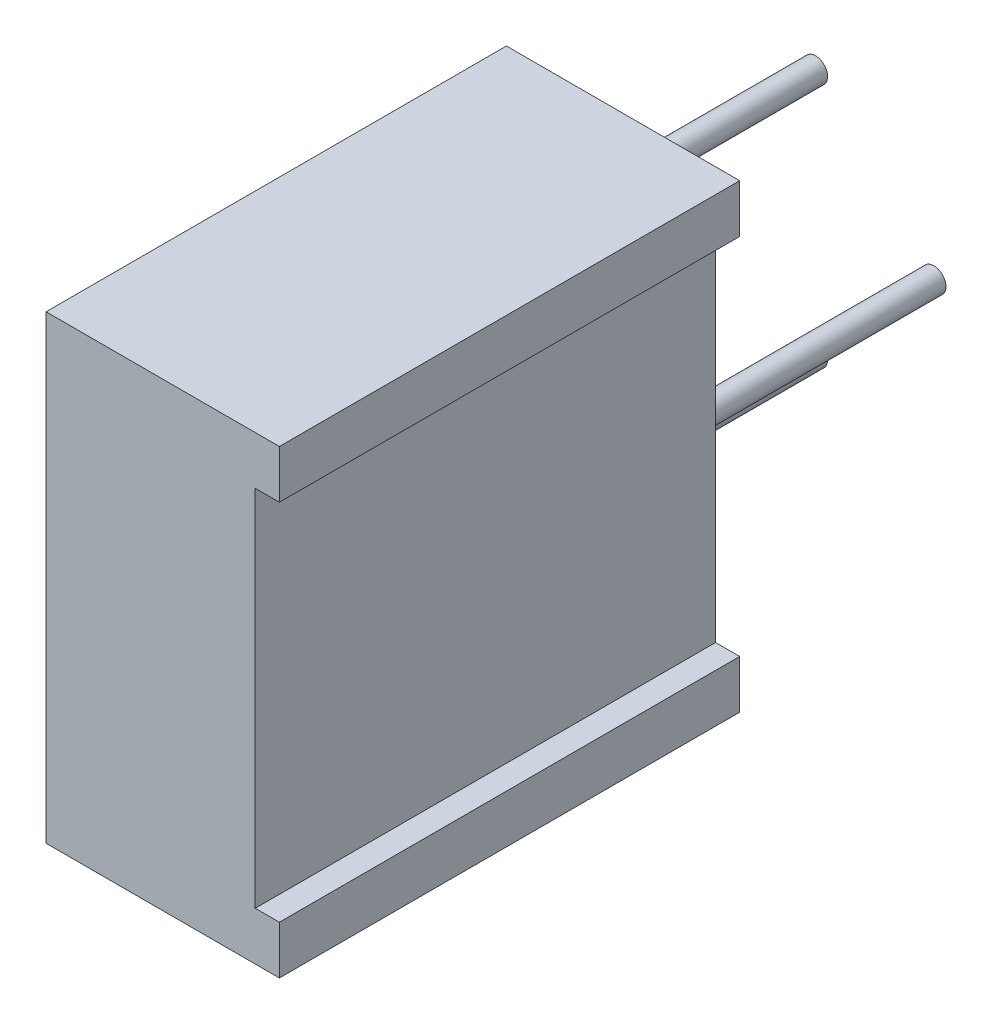
ISO-10303-21;
HEADER;
FILE_DESCRIPTION(('STEP AP214'),'2;1');
FILE_NAME('part.step','',(''),(''),'','','');
FILE_SCHEMA(('AUTOMOTIVE_DESIGN { 1 0 10303 214 1 1 1 1 }'));
ENDSEC;
DATA;
#1=APPLICATION_CONTEXT('core data for automotive mechanical design processes');
#2=APPLICATION_PROTOCOL_DEFINITION('international standard','automotive_design',2000,#1);
#3=PRODUCT_CONTEXT('',#1,'mechanical');
#4=PRODUCT('Part','Part','',(#3));
#5=PRODUCT_RELATED_PRODUCT_CATEGORY('part','',(#4));
#6=PRODUCT_DEFINITION_FORMATION('','',#4);
#7=PRODUCT_DEFINITION_CONTEXT('part definition',#1,'design');
#8=PRODUCT_DEFINITION('design','',#6,#7);
#9=PRODUCT_DEFINITION_SHAPE('','',#8);
#10=(LENGTH_UNIT() NAMED_UNIT(*) SI_UNIT(.MILLI.,.METRE.));
#11=(NAMED_UNIT(*) PLANE_ANGLE_UNIT() SI_UNIT($,.RADIAN.));
#12=(NAMED_UNIT(*) SI_UNIT($,.STERADIAN.) SOLID_ANGLE_UNIT());
#13=UNCERTAINTY_MEASURE_WITH_UNIT(LENGTH_MEASURE(1.E-05),#10,'distance_accuracy_value','');
#14=(GEOMETRIC_REPRESENTATION_CONTEXT(3) GLOBAL_UNCERTAINTY_ASSIGNED_CONTEXT((#13)) GLOBAL_UNIT_ASSIGNED_CONTEXT((#10,
#11,#12)) REPRESENTATION_CONTEXT('',''));
#15=CARTESIAN_POINT('',(0.,0.,0.));
#16=DIRECTION('',(0.,0.,1.));
#17=DIRECTION('',(1.,0.,0.));
#18=AXIS2_PLACEMENT_3D('',#15,#16,#17);
#19=CARTESIAN_POINT('',(4.83,0.,0.));
#20=DIRECTION('',(-1.,0.,0.));
#21=DIRECTION('',(0.,0.,1.));
#22=AXIS2_PLACEMENT_3D('',#19,#20,#21);
#23=PLANE('',#22);
#24=DIRECTION('',(0.,0.,1.));
#25=VECTOR('',#24,1.);
#26=CARTESIAN_POINT('',(4.83,-1.,0.));
#27=LINE('',#26,#25);
#28=CARTESIAN_POINT('',(4.83,-1.,0.));
#29=VERTEX_POINT('',#28);
#30=CARTESIAN_POINT('',(4.83,-1.,9.52999999999999));
#31=VERTEX_POINT('',#30);
#32=EDGE_CURVE('E42',#29,#31,#27,.T.);
#33=ORIENTED_EDGE('',*,*,#32,.F.);
#34=DIRECTION('',(0.,-1.,0.));
#35=VECTOR('',#34,1.);
#36=CARTESIAN_POINT('',(4.83,0.,0.));
#37=LINE('',#36,#35);
#38=CARTESIAN_POINT('',(4.83,0.,0.));
#39=VERTEX_POINT('',#38);
#40=EDGE_CURVE('E185',#39,#29,#37,.T.);
#41=ORIENTED_EDGE('',*,*,#40,.F.);
#42=DIRECTION('',(0.,0.,1.));
#43=VECTOR('',#42,1.);
#44=CARTESIAN_POINT('',(4.83,0.,0.));
#45=LINE('',#44,#43);
#46=CARTESIAN_POINT('',(4.83,0.,9.52999999999999));
#47=VERTEX_POINT('',#46);
#48=EDGE_CURVE('E146',#39,#47,#45,.T.);
#49=ORIENTED_EDGE('',*,*,#48,.T.);
#50=DIRECTION('',(0.,1.,0.));
#51=VECTOR('',#50,1.);
#52=CARTESIAN_POINT('',(4.83,-9.53,9.53));
#53=LINE('',#52,#51);
#54=EDGE_CURVE('E147',#31,#47,#53,.T.);
#55=ORIENTED_EDGE('',*,*,#54,.F.);
#56=EDGE_LOOP('',(#33,#41,#49,#55));
#57=FACE_BOUND('',#56,.T.);
#58=ADVANCED_FACE('F34',(#57),#23,.F.);
#59=CARTESIAN_POINT('',(4.83,0.,0.));
#60=DIRECTION('',(0.,0.,-1.));
#61=DIRECTION('',(-1.,0.,0.));
#62=AXIS2_PLACEMENT_3D('',#59,#60,#61);
#63=PLANE('',#62);
#64=DIRECTION('',(-1.,0.,0.));
#65=VECTOR('',#64,1.);
#66=CARTESIAN_POINT('',(4.83,-8.53,0.));
#67=LINE('',#66,#65);
#68=CARTESIAN_POINT('',(4.83,-8.53,0.));
#69=VERTEX_POINT('',#68);
#70=CARTESIAN_POINT('',(4.33,-8.53,0.));
#71=VERTEX_POINT('',#70);
#72=EDGE_CURVE('E249',#69,#71,#67,.T.);
#73=ORIENTED_EDGE('',*,*,#72,.F.);
#74=CARTESIAN_POINT('',(4.83,-9.53,0.));
#75=VERTEX_POINT('',#74);
#76=EDGE_CURVE('E141',#69,#75,#37,.T.);
#77=ORIENTED_EDGE('',*,*,#76,.T.);
#78=DIRECTION('',(-1.,0.,0.));
#79=VECTOR('',#78,1.);
#80=CARTESIAN_POINT('',(4.83,-9.53,0.));
#81=LINE('',#80,#79);
#82=CARTESIAN_POINT('',(0.,-9.53,0.));
#83=VERTEX_POINT('',#82);
#84=EDGE_CURVE('E150',#75,#83,#81,.T.);
#85=ORIENTED_EDGE('',*,*,#84,.T.);
#86=DIRECTION('',(0.,-1.,0.));
#87=VECTOR('',#86,1.);
#88=CARTESIAN_POINT('',(0.,0.,0.));
#89=LINE('',#88,#87);
#90=CARTESIAN_POINT('',(0.,0.,0.));
#91=VERTEX_POINT('',#90);
#92=EDGE_CURVE('E156',#91,#83,#89,.T.);
#93=ORIENTED_EDGE('',*,*,#92,.F.);
#94=DIRECTION('',(-1.,0.,0.));
#95=VECTOR('',#94,1.);
#96=CARTESIAN_POINT('',(4.83,0.,0.));
#97=LINE('',#96,#95);
#98=EDGE_CURVE('E169',#39,#91,#97,.T.);
#99=ORIENTED_EDGE('',*,*,#98,.F.);
#100=ORIENTED_EDGE('',*,*,#40,.T.);
#101=DIRECTION('',(-1.,0.,0.));
#102=VECTOR('',#101,1.);
#103=CARTESIAN_POINT('',(4.83,-1.,0.));
#104=LINE('',#103,#102);
#105=CARTESIAN_POINT('',(4.33,-1.,0.));
#106=VERTEX_POINT('',#105);
#107=EDGE_CURVE('E49',#29,#106,#104,.T.);
#108=ORIENTED_EDGE('',*,*,#107,.T.);
#109=DIRECTION('',(0.,-1.,0.));
#110=VECTOR('',#109,1.);
#111=CARTESIAN_POINT('',(4.33,0.,0.));
#112=LINE('',#111,#110);
#113=EDGE_CURVE('E244',#106,#71,#112,.T.);
#114=ORIENTED_EDGE('',*,*,#113,.T.);
#115=EDGE_LOOP('',(#73,#77,#85,#93,#99,#100,#108,#114));
#116=FACE_BOUND('',#115,.T.);
#117=CARTESIAN_POINT('',(3.84999999999999,-4.76500000000001,0.));
#118=DIRECTION('',(0.,0.,-1.));
#119=DIRECTION('',(-1.,0.,0.));
#120=AXIS2_PLACEMENT_3D('',#117,#118,#119);
#121=CIRCLE('',#120,0.25);
#122=CARTESIAN_POINT('',(3.59999999999999,-4.76500000000001,0.));
#123=VERTEX_POINT('',#122);
#124=EDGE_CURVE('E235',#123,#123,#121,.T.);
#125=ORIENTED_EDGE('',*,*,#124,.F.);
#126=EDGE_LOOP('',(#125));
#127=FACE_BOUND('',#126,.T.);
#128=CARTESIAN_POINT('',(1.39999999999999,-2.22500000000001,0.));
#129=DIRECTION('',(0.,0.,-1.));
#130=DIRECTION('',(-1.,0.,0.));
#131=AXIS2_PLACEMENT_3D('',#128,#129,#130);
#132=CIRCLE('',#131,0.25);
#133=CARTESIAN_POINT('',(1.14999999999999,-2.22500000000001,0.));
#134=VERTEX_POINT('',#133);
#135=EDGE_CURVE('E229',#134,#134,#132,.T.);
#136=ORIENTED_EDGE('',*,*,#135,.F.);
#137=EDGE_LOOP('',(#136));
#138=FACE_BOUND('',#137,.T.);
#139=CARTESIAN_POINT('',(1.39999999999999,-7.30500000000001,0.));
#140=DIRECTION('',(0.,0.,-1.));
#141=DIRECTION('',(-1.,0.,0.));
#142=AXIS2_PLACEMENT_3D('',#139,#140,#141);
#143=CIRCLE('',#142,0.25);
#144=CARTESIAN_POINT('',(1.14999999999999,-7.30500000000001,0.));
#145=VERTEX_POINT('',#144);
#146=EDGE_CURVE('E241',#145,#145,#143,.T.);
#147=ORIENTED_EDGE('',*,*,#146,.F.);
#148=EDGE_LOOP('',(#147));
#149=FACE_BOUND('',#148,.T.);
#150=ADVANCED_FACE('F36',(#116,#127,#138,#149),#63,.T.);
#151=CARTESIAN_POINT('',(0.1,-4.76500000000001,4.76500000000001));
#152=DIRECTION('',(1.,0.,0.));
#153=DIRECTION('',(0.,0.,-1.));
#154=AXIS2_PLACEMENT_3D('',#151,#152,#153);
#155=PLANE('',#154);
#156=DIRECTION('',(0.,-0.707106781186551,-0.707106781186544));
#157=VECTOR('',#156,1.);
#158=CARTESIAN_POINT('',(0.1,-3.74924699683036,6.48785978435619));
#159=LINE('',#158,#157);
#160=CARTESIAN_POINT('',(0.1,-3.74924699683036,6.48785978435619));
#161=VERTEX_POINT('',#160);
#162=CARTESIAN_POINT('',(0.1,-6.4878597843562,3.74924699683038));
#163=VERTEX_POINT('',#162);
#164=EDGE_CURVE('E217',#161,#163,#159,.T.);
#165=ORIENTED_EDGE('',*,*,#164,.T.);
#166=CARTESIAN_POINT('',(0.1,-4.76500000000001,4.76500000000001));
#167=DIRECTION('',(1.,0.,0.));
#168=DIRECTION('',(0.,0.,-1.));
#169=AXIS2_PLACEMENT_3D('',#166,#167,#168);
#170=CIRCLE('',#169,2.);
#171=EDGE_CURVE('E160',#161,#163,#170,.T.);
#172=ORIENTED_EDGE('',*,*,#171,.F.);
#173=EDGE_LOOP('',(#165,#172));
#174=FACE_BOUND('',#173,.T.);
#175=ADVANCED_FACE('F259',(#174),#155,.F.);
#176=CARTESIAN_POINT('',(0.,0.,0.));
#177=DIRECTION('',(-1.,0.,0.));
#178=DIRECTION('',(0.,0.,1.));
#179=AXIS2_PLACEMENT_3D('',#176,#177,#178);
#180=PLANE('',#179);
#181=ORIENTED_EDGE('',*,*,#92,.T.);
#182=DIRECTION('',(0.,0.,-1.));
#183=VECTOR('',#182,1.);
#184=CARTESIAN_POINT('',(0.,-9.53,9.53));
#185=LINE('',#184,#183);
#186=CARTESIAN_POINT('',(0.,-9.53,9.53));
#187=VERTEX_POINT('',#186);
#188=EDGE_CURVE('E159',#187,#83,#185,.T.);
#189=ORIENTED_EDGE('',*,*,#188,.F.);
#190=DIRECTION('',(0.,1.,0.));
#191=VECTOR('',#190,1.);
#192=CARTESIAN_POINT('',(0.,-9.53,9.53));
#193=LINE('',#192,#191);
#194=CARTESIAN_POINT('',(0.,0.,9.52999999999999));
#195=VERTEX_POINT('',#194);
#196=EDGE_CURVE('E163',#187,#195,#193,.T.);
#197=ORIENTED_EDGE('',*,*,#196,.T.);
#198=DIRECTION('',(0.,0.,1.));
#199=VECTOR('',#198,1.);
#200=CARTESIAN_POINT('',(0.,0.,0.));
#201=LINE('',#200,#199);
#202=EDGE_CURVE('E166',#91,#195,#201,.T.);
#203=ORIENTED_EDGE('',*,*,#202,.F.);
#204=EDGE_LOOP('',(#181,#189,#197,#203));
#205=FACE_BOUND('',#204,.T.);
#206=CARTESIAN_POINT('',(0.,-4.76500000000001,4.76500000000001));
#207=DIRECTION('',(1.,0.,0.));
#208=DIRECTION('',(0.,0.,-1.));
#209=AXIS2_PLACEMENT_3D('',#206,#207,#208);
#210=CIRCLE('',#209,2.);
#211=CARTESIAN_POINT('',(0.,-4.76500000000001,2.76500000000001));
#212=VERTEX_POINT('',#211);
#213=EDGE_CURVE('E199',#212,#212,#210,.T.);
#214=ORIENTED_EDGE('',*,*,#213,.T.);
#215=EDGE_LOOP('',(#214));
#216=FACE_BOUND('',#215,.T.);
#217=ADVANCED_FACE('F191',(#205,#216),#180,.T.);
#218=CARTESIAN_POINT('',(4.83,0.,0.));
#219=DIRECTION('',(0.,-1.,0.));
#220=DIRECTION('',(0.,0.,-1.));
#221=AXIS2_PLACEMENT_3D('',#218,#219,#220);
#222=PLANE('',#221);
#223=ORIENTED_EDGE('',*,*,#202,.T.);
#224=DIRECTION('',(-1.,0.,0.));
#225=VECTOR('',#224,1.);
#226=CARTESIAN_POINT('',(4.83,0.,9.52999999999999));
#227=LINE('',#226,#225);
#228=EDGE_CURVE('E171',#47,#195,#227,.T.);
#229=ORIENTED_EDGE('',*,*,#228,.F.);
#230=ORIENTED_EDGE('',*,*,#48,.F.);
#231=ORIENTED_EDGE('',*,*,#98,.T.);
#232=EDGE_LOOP('',(#223,#229,#230,#231));
#233=FACE_BOUND('',#232,.T.);
#234=ADVANCED_FACE('F187',(#233),#222,.F.);
#235=CARTESIAN_POINT('',(4.83,-9.53,9.53));
#236=DIRECTION('',(0.,0.,1.));
#237=DIRECTION('',(0.,-1.,0.));
#238=AXIS2_PLACEMENT_3D('',#235,#236,#237);
#239=PLANE('',#238);
#240=DIRECTION('',(1.,0.,0.));
#241=VECTOR('',#240,1.);
#242=CARTESIAN_POINT('',(4.33,-8.53,9.52999999999999));
#243=LINE('',#242,#241);
#244=CARTESIAN_POINT('',(4.33,-8.53,9.52999999999999));
#245=VERTEX_POINT('',#244);
#246=CARTESIAN_POINT('',(4.83,-8.53,9.52999999999999));
#247=VERTEX_POINT('',#246);
#248=EDGE_CURVE('E124',#245,#247,#243,.T.);
#249=ORIENTED_EDGE('',*,*,#248,.F.);
#250=DIRECTION('',(0.,1.,0.));
#251=VECTOR('',#250,1.);
#252=CARTESIAN_POINT('',(4.33,-8.53,9.52999999999999));
#253=LINE('',#252,#251);
#254=CARTESIAN_POINT('',(4.33,-1.,9.52999999999999));
#255=VERTEX_POINT('',#254);
#256=EDGE_CURVE('E181',#245,#255,#253,.T.);
#257=ORIENTED_EDGE('',*,*,#256,.T.);
#258=DIRECTION('',(1.,0.,0.));
#259=VECTOR('',#258,1.);
#260=CARTESIAN_POINT('',(4.33,-1.,9.52999999999999));
#261=LINE('',#260,#259);
#262=EDGE_CURVE('E133',#255,#31,#261,.T.);
#263=ORIENTED_EDGE('',*,*,#262,.T.);
#264=ORIENTED_EDGE('',*,*,#54,.T.);
#265=ORIENTED_EDGE('',*,*,#228,.T.);
#266=ORIENTED_EDGE('',*,*,#196,.F.);
#267=DIRECTION('',(-1.,0.,0.));
#268=VECTOR('',#267,1.);
#269=CARTESIAN_POINT('',(4.83,-9.53,9.53));
#270=LINE('',#269,#268);
#271=CARTESIAN_POINT('',(4.83,-9.53,9.53));
#272=VERTEX_POINT('',#271);
#273=EDGE_CURVE('E144',#272,#187,#270,.T.);
#274=ORIENTED_EDGE('',*,*,#273,.F.);
#275=EDGE_CURVE('E140',#272,#247,#53,.T.);
#276=ORIENTED_EDGE('',*,*,#275,.T.);
#277=EDGE_LOOP('',(#249,#257,#263,#264,#265,#266,#274,#276));
#278=FACE_BOUND('',#277,.T.);
#279=ADVANCED_FACE('F142',(#278),#239,.T.);
#280=CARTESIAN_POINT('',(4.83,-9.53,9.53));
#281=DIRECTION('',(0.,1.,0.));
#282=DIRECTION('',(0.,0.,1.));
#283=AXIS2_PLACEMENT_3D('',#280,#281,#282);
#284=PLANE('',#283);
#285=ORIENTED_EDGE('',*,*,#188,.T.);
#286=ORIENTED_EDGE('',*,*,#84,.F.);
#287=DIRECTION('',(0.,0.,-1.));
#288=VECTOR('',#287,1.);
#289=CARTESIAN_POINT('',(4.83,-9.53,9.53));
#290=LINE('',#289,#288);
#291=EDGE_CURVE('E152',#272,#75,#290,.T.);
#292=ORIENTED_EDGE('',*,*,#291,.F.);
#293=ORIENTED_EDGE('',*,*,#273,.T.);
#294=EDGE_LOOP('',(#285,#286,#292,#293));
#295=FACE_BOUND('',#294,.T.);
#296=ADVANCED_FACE('F196',(#295),#284,.F.);
#297=ORIENTED_EDGE('',*,*,#76,.F.);
#298=DIRECTION('',(0.,0.,1.));
#299=VECTOR('',#298,1.);
#300=CARTESIAN_POINT('',(4.83,-8.53,0.));
#301=LINE('',#300,#299);
#302=EDGE_CURVE('E12',#69,#247,#301,.T.);
#303=ORIENTED_EDGE('',*,*,#302,.T.);
#304=ORIENTED_EDGE('',*,*,#275,.F.);
#305=ORIENTED_EDGE('',*,*,#291,.T.);
#306=EDGE_LOOP('',(#297,#303,#304,#305));
#307=FACE_BOUND('',#306,.T.);
#308=ADVANCED_FACE('F138',(#307),#23,.F.);
#309=CARTESIAN_POINT('',(0.1,-4.76500000000001,4.76500000000001));
#310=DIRECTION('',(-1.,0.,0.));
#311=DIRECTION('',(0.,0.,1.));
#312=AXIS2_PLACEMENT_3D('',#309,#310,#311);
#313=CYLINDRICAL_SURFACE('',#312,2.);
#314=CARTESIAN_POINT('',(0.1,-5.78075300316966,3.04214021564382));
#315=VERTEX_POINT('',#314);
#316=CARTESIAN_POINT('',(0.1,-3.04214021564381,5.78075300316964));
#317=VERTEX_POINT('',#316);
#318=EDGE_CURVE('E202',#315,#317,#170,.T.);
#319=ORIENTED_EDGE('',*,*,#318,.T.);
#320=DIRECTION('',(-1.,0.,0.));
#321=VECTOR('',#320,1.);
#322=CARTESIAN_POINT('',(1.1,-3.04214021564381,5.78075300316964));
#323=LINE('',#322,#321);
#324=CARTESIAN_POINT('',(1.1,-3.04214021564381,5.78075300316964));
#325=VERTEX_POINT('',#324);
#326=EDGE_CURVE('E210',#325,#317,#323,.T.);
#327=ORIENTED_EDGE('',*,*,#326,.F.);
#328=CARTESIAN_POINT('',(1.1,-4.76500000000001,4.76500000000001));
#329=DIRECTION('',(-1.,0.,0.));
#330=DIRECTION('',(0.,0.,1.));
#331=AXIS2_PLACEMENT_3D('',#328,#329,#330);
#332=CIRCLE('',#331,2.);
#333=CARTESIAN_POINT('',(1.1,-3.74924699683036,6.48785978435619));
#334=VERTEX_POINT('',#333);
#335=EDGE_CURVE('E222',#334,#325,#332,.T.);
#336=ORIENTED_EDGE('',*,*,#335,.F.);
#337=DIRECTION('',(-1.,0.,0.));
#338=VECTOR('',#337,1.);
#339=CARTESIAN_POINT('',(1.1,-3.74924699683036,6.48785978435619));
#340=LINE('',#339,#338);
#341=EDGE_CURVE('E207',#334,#161,#340,.T.);
#342=ORIENTED_EDGE('',*,*,#341,.T.);
#343=ORIENTED_EDGE('',*,*,#171,.T.);
#344=DIRECTION('',(-1.,0.,0.));
#345=VECTOR('',#344,1.);
#346=CARTESIAN_POINT('',(1.1,-6.4878597843562,3.74924699683037));
#347=LINE('',#346,#345);
#348=CARTESIAN_POINT('',(1.1,-6.4878597843562,3.74924699683037));
#349=VERTEX_POINT('',#348);
#350=EDGE_CURVE('E57',#349,#163,#347,.T.);
#351=ORIENTED_EDGE('',*,*,#350,.F.);
#352=CARTESIAN_POINT('',(1.1,-4.76500000000001,4.76500000000001));
#353=DIRECTION('',(-1.,0.,0.));
#354=DIRECTION('',(0.,0.,1.));
#355=AXIS2_PLACEMENT_3D('',#352,#353,#354);
#356=CIRCLE('',#355,2.);
#357=CARTESIAN_POINT('',(1.1,-5.78075300316966,3.04214021564382));
#358=VERTEX_POINT('',#357);
#359=EDGE_CURVE('E216',#358,#349,#356,.T.);
#360=ORIENTED_EDGE('',*,*,#359,.F.);
#361=DIRECTION('',(-1.,0.,0.));
#362=VECTOR('',#361,1.);
#363=CARTESIAN_POINT('',(1.1,-5.78075300316966,3.04214021564382));
#364=LINE('',#363,#362);
#365=EDGE_CURVE('E203',#358,#315,#364,.T.);
#366=ORIENTED_EDGE('',*,*,#365,.T.);
#367=EDGE_LOOP('',(#319,#327,#336,#342,#343,#351,#360,#366));
#368=FACE_BOUND('',#367,.T.);
#369=ORIENTED_EDGE('',*,*,#213,.F.);
#370=EDGE_LOOP('',(#369));
#371=FACE_BOUND('',#370,.T.);
#372=ADVANCED_FACE('F289',(#368,#371),#313,.F.);
#373=ORIENTED_EDGE('',*,*,#318,.F.);
#374=DIRECTION('',(0.,-0.707106781186551,-0.707106781186544));
#375=VECTOR('',#374,1.);
#376=CARTESIAN_POINT('',(0.1,-3.04214021564381,5.78075300316964));
#377=LINE('',#376,#375);
#378=EDGE_CURVE('E213',#317,#315,#377,.T.);
#379=ORIENTED_EDGE('',*,*,#378,.F.);
#380=EDGE_LOOP('',(#373,#379));
#381=FACE_BOUND('',#380,.T.);
#382=ADVANCED_FACE('F294',(#381),#155,.F.);
#383=CARTESIAN_POINT('',(1.1,-3.04214021564381,5.78075300316964));
#384=DIRECTION('',(0.,0.707106781186544,-0.707106781186551));
#385=DIRECTION('',(0.,0.707106781186551,0.707106781186544));
#386=AXIS2_PLACEMENT_3D('',#383,#384,#385);
#387=PLANE('',#386);
#388=ORIENTED_EDGE('',*,*,#378,.T.);
#389=ORIENTED_EDGE('',*,*,#365,.F.);
#390=DIRECTION('',(0.,-0.707106781186551,-0.707106781186544));
#391=VECTOR('',#390,1.);
#392=CARTESIAN_POINT('',(1.1,-3.04214021564381,5.78075300316964));
#393=LINE('',#392,#391);
#394=EDGE_CURVE('E208',#325,#358,#393,.T.);
#395=ORIENTED_EDGE('',*,*,#394,.F.);
#396=ORIENTED_EDGE('',*,*,#326,.T.);
#397=EDGE_LOOP('',(#388,#389,#395,#396));
#398=FACE_BOUND('',#397,.T.);
#399=ADVANCED_FACE('F312',(#398),#387,.F.);
#400=CARTESIAN_POINT('',(1.1,-3.74924699683036,6.48785978435619));
#401=DIRECTION('',(0.,0.707106781186544,-0.707106781186551));
#402=DIRECTION('',(0.,0.707106781186551,0.707106781186544));
#403=AXIS2_PLACEMENT_3D('',#400,#401,#402);
#404=PLANE('',#403);
#405=ORIENTED_EDGE('',*,*,#164,.F.);
#406=ORIENTED_EDGE('',*,*,#341,.F.);
#407=DIRECTION('',(0.,-0.707106781186551,-0.707106781186544));
#408=VECTOR('',#407,1.);
#409=CARTESIAN_POINT('',(1.1,-3.74924699683036,6.48785978435619));
#410=LINE('',#409,#408);
#411=EDGE_CURVE('E225',#334,#349,#410,.T.);
#412=ORIENTED_EDGE('',*,*,#411,.T.);
#413=ORIENTED_EDGE('',*,*,#350,.T.);
#414=EDGE_LOOP('',(#405,#406,#412,#413));
#415=FACE_BOUND('',#414,.T.);
#416=ADVANCED_FACE('F317',(#415),#404,.T.);
#417=CARTESIAN_POINT('',(1.1,-4.76500000000001,4.76500000000001));
#418=DIRECTION('',(-1.,0.,0.));
#419=DIRECTION('',(0.,0.,1.));
#420=AXIS2_PLACEMENT_3D('',#417,#418,#419);
#421=PLANE('',#420);
#422=ORIENTED_EDGE('',*,*,#359,.T.);
#423=ORIENTED_EDGE('',*,*,#411,.F.);
#424=ORIENTED_EDGE('',*,*,#335,.T.);
#425=ORIENTED_EDGE('',*,*,#394,.T.);
#426=EDGE_LOOP('',(#422,#423,#424,#425));
#427=FACE_BOUND('',#426,.T.);
#428=ADVANCED_FACE('F327',(#427),#421,.T.);
#429=CARTESIAN_POINT('',(1.39999999999999,-2.22500000000001,-5.));
#430=DIRECTION('',(0.,0.,1.));
#431=DIRECTION('',(1.,0.,0.));
#432=AXIS2_PLACEMENT_3D('',#429,#430,#431);
#433=CYLINDRICAL_SURFACE('',#432,0.25);
#434=CARTESIAN_POINT('',(1.39999999999999,-2.22500000000001,-5.));
#435=DIRECTION('',(0.,0.,-1.));
#436=DIRECTION('',(-1.,0.,0.));
#437=AXIS2_PLACEMENT_3D('',#434,#435,#436);
#438=CIRCLE('',#437,0.25);
#439=CARTESIAN_POINT('',(1.14999999999999,-2.22500000000001,-5.));
#440=VERTEX_POINT('',#439);
#441=EDGE_CURVE('E219',#440,#440,#438,.T.);
#442=ORIENTED_EDGE('',*,*,#441,.F.);
#443=EDGE_LOOP('',(#442));
#444=FACE_BOUND('',#443,.T.);
#445=ORIENTED_EDGE('',*,*,#135,.T.);
#446=EDGE_LOOP('',(#445));
#447=FACE_BOUND('',#446,.T.);
#448=ADVANCED_FACE('F335',(#444,#447),#433,.T.);
#449=CARTESIAN_POINT('',(1.39999999999999,-2.22500000000001,-5.));
#450=DIRECTION('',(0.,0.,-1.));
#451=DIRECTION('',(-1.,0.,0.));
#452=AXIS2_PLACEMENT_3D('',#449,#450,#451);
#453=PLANE('',#452);
#454=ORIENTED_EDGE('',*,*,#441,.T.);
#455=EDGE_LOOP('',(#454));
#456=FACE_BOUND('',#455,.T.);
#457=ADVANCED_FACE('F340',(#456),#453,.T.);
#458=CARTESIAN_POINT('',(3.84999999999999,-4.76500000000001,-5.));
#459=DIRECTION('',(0.,0.,1.));
#460=DIRECTION('',(1.,0.,0.));
#461=AXIS2_PLACEMENT_3D('',#458,#459,#460);
#462=CYLINDRICAL_SURFACE('',#461,0.25);
#463=CARTESIAN_POINT('',(3.84999999999999,-4.76500000000001,-5.));
#464=DIRECTION('',(0.,0.,-1.));
#465=DIRECTION('',(-1.,0.,0.));
#466=AXIS2_PLACEMENT_3D('',#463,#464,#465);
#467=CIRCLE('',#466,0.25);
#468=CARTESIAN_POINT('',(3.59999999999999,-4.76500000000001,-5.));
#469=VERTEX_POINT('',#468);
#470=EDGE_CURVE('E232',#469,#469,#467,.T.);
#471=ORIENTED_EDGE('',*,*,#470,.F.);
#472=EDGE_LOOP('',(#471));
#473=FACE_BOUND('',#472,.T.);
#474=ORIENTED_EDGE('',*,*,#124,.T.);
#475=EDGE_LOOP('',(#474));
#476=FACE_BOUND('',#475,.T.);
#477=ADVANCED_FACE('F278',(#473,#476),#462,.T.);
#478=CARTESIAN_POINT('',(3.84999999999999,-4.76500000000001,-5.));
#479=DIRECTION('',(0.,0.,-1.));
#480=DIRECTION('',(-1.,0.,0.));
#481=AXIS2_PLACEMENT_3D('',#478,#479,#480);
#482=PLANE('',#481);
#483=ORIENTED_EDGE('',*,*,#470,.T.);
#484=EDGE_LOOP('',(#483));
#485=FACE_BOUND('',#484,.T.);
#486=ADVANCED_FACE('F269',(#485),#482,.T.);
#487=CARTESIAN_POINT('',(1.39999999999999,-7.30500000000001,-5.));
#488=DIRECTION('',(0.,0.,1.));
#489=DIRECTION('',(1.,0.,0.));
#490=AXIS2_PLACEMENT_3D('',#487,#488,#489);
#491=CYLINDRICAL_SURFACE('',#490,0.25);
#492=CARTESIAN_POINT('',(1.39999999999999,-7.30500000000001,-5.));
#493=DIRECTION('',(0.,0.,-1.));
#494=DIRECTION('',(-1.,0.,0.));
#495=AXIS2_PLACEMENT_3D('',#492,#493,#494);
#496=CIRCLE('',#495,0.25);
#497=CARTESIAN_POINT('',(1.14999999999999,-7.30500000000001,-5.));
#498=VERTEX_POINT('',#497);
#499=EDGE_CURVE('E238',#498,#498,#496,.T.);
#500=ORIENTED_EDGE('',*,*,#499,.F.);
#501=EDGE_LOOP('',(#500));
#502=FACE_BOUND('',#501,.T.);
#503=ORIENTED_EDGE('',*,*,#146,.T.);
#504=EDGE_LOOP('',(#503));
#505=FACE_BOUND('',#504,.T.);
#506=ADVANCED_FACE('F266',(#502,#505),#491,.T.);
#507=CARTESIAN_POINT('',(1.39999999999999,-7.30500000000001,-5.));
#508=DIRECTION('',(0.,0.,-1.));
#509=DIRECTION('',(-1.,0.,0.));
#510=AXIS2_PLACEMENT_3D('',#507,#508,#509);
#511=PLANE('',#510);
#512=ORIENTED_EDGE('',*,*,#499,.T.);
#513=EDGE_LOOP('',(#512));
#514=FACE_BOUND('',#513,.T.);
#515=ADVANCED_FACE('F268',(#514),#511,.T.);
#516=CARTESIAN_POINT('',(4.33,-8.53,-5.));
#517=DIRECTION('',(0.,-1.,0.));
#518=DIRECTION('',(0.,0.,-1.));
#519=AXIS2_PLACEMENT_3D('',#516,#517,#518);
#520=PLANE('',#519);
#521=ORIENTED_EDGE('',*,*,#72,.T.);
#522=DIRECTION('',(0.,0.,1.));
#523=VECTOR('',#522,1.);
#524=CARTESIAN_POINT('',(4.33,-8.53,-5.));
#525=LINE('',#524,#523);
#526=EDGE_CURVE('E128',#71,#245,#525,.T.);
#527=ORIENTED_EDGE('',*,*,#526,.T.);
#528=ORIENTED_EDGE('',*,*,#248,.T.);
#529=ORIENTED_EDGE('',*,*,#302,.F.);
#530=EDGE_LOOP('',(#521,#527,#528,#529));
#531=FACE_BOUND('',#530,.T.);
#532=ADVANCED_FACE('F125',(#531),#520,.F.);
#533=CARTESIAN_POINT('',(4.33,-8.53,-5.));
#534=DIRECTION('',(1.,0.,0.));
#535=DIRECTION('',(0.,1.,0.));
#536=AXIS2_PLACEMENT_3D('',#533,#534,#535);
#537=PLANE('',#536);
#538=DIRECTION('',(0.,0.,1.));
#539=VECTOR('',#538,1.);
#540=CARTESIAN_POINT('',(4.33,-1.,-5.));
#541=LINE('',#540,#539);
#542=EDGE_CURVE('E252',#106,#255,#541,.T.);
#543=ORIENTED_EDGE('',*,*,#542,.T.);
#544=ORIENTED_EDGE('',*,*,#256,.F.);
#545=ORIENTED_EDGE('',*,*,#526,.F.);
#546=ORIENTED_EDGE('',*,*,#113,.F.);
#547=EDGE_LOOP('',(#543,#544,#545,#546));
#548=FACE_BOUND('',#547,.T.);
#549=ADVANCED_FACE('F256',(#548),#537,.T.);
#550=CARTESIAN_POINT('',(4.33,-1.,-5.));
#551=DIRECTION('',(0.,-1.,0.));
#552=DIRECTION('',(1.,0.,0.));
#553=AXIS2_PLACEMENT_3D('',#550,#551,#552);
#554=PLANE('',#553);
#555=ORIENTED_EDGE('',*,*,#32,.T.);
#556=ORIENTED_EDGE('',*,*,#262,.F.);
#557=ORIENTED_EDGE('',*,*,#542,.F.);
#558=ORIENTED_EDGE('',*,*,#107,.F.);
#559=EDGE_LOOP('',(#555,#556,#557,#558));
#560=FACE_BOUND('',#559,.T.);
#561=ADVANCED_FACE('F176',(#560),#554,.T.);
#562=CLOSED_SHELL('',(#58,#150,#175,#217,#234,#279,#296,#308,#372,#382,#399,#416,#428,#448,#457,
#477,#486,#506,#515,#532,#549,#561));
#563=MANIFOLD_SOLID_BREP('B2',#562);
#564=ADVANCED_BREP_SHAPE_REPRESENTATION('',(#18,#563),#14);
#565=SHAPE_DEFINITION_REPRESENTATION(#9,#564);
ENDSEC;
END-ISO-10303-21;
